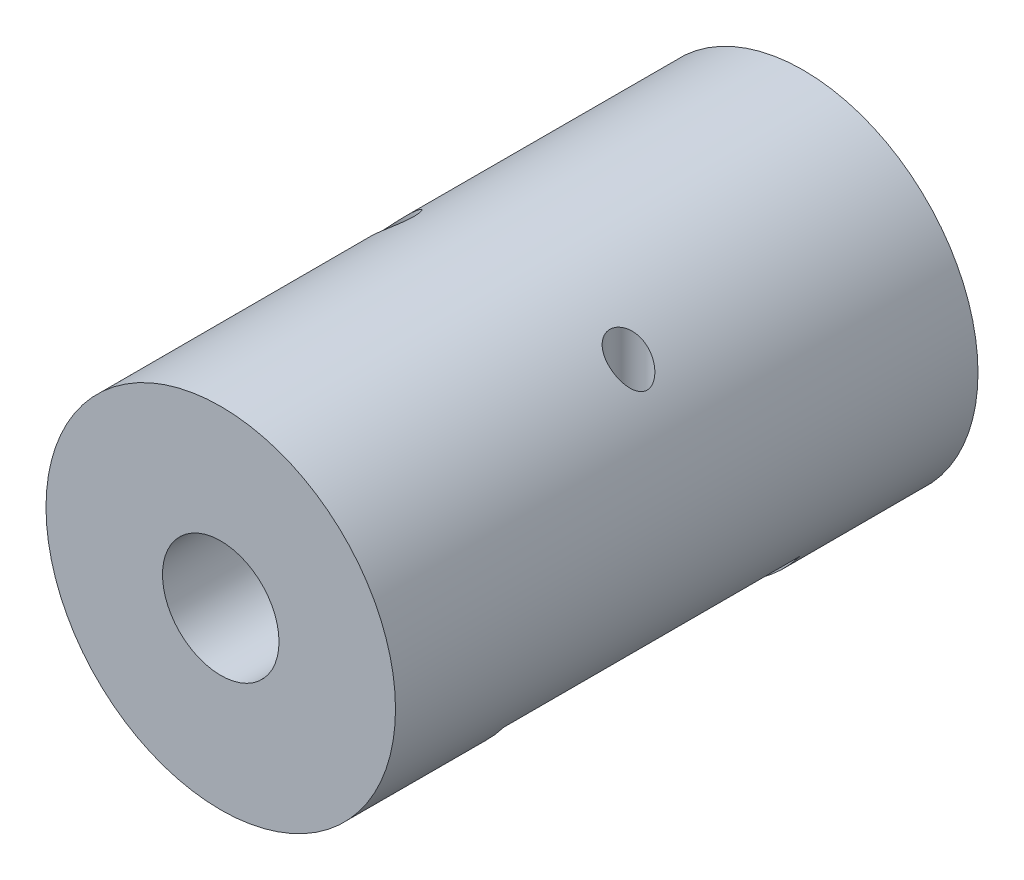
ISO-10303-21;
HEADER;
FILE_DESCRIPTION(('STEP AP214'),'2;1');
FILE_NAME('part.step','',(''),(''),'','','');
FILE_SCHEMA(('AUTOMOTIVE_DESIGN { 1 0 10303 214 1 1 1 1 }'));
ENDSEC;
DATA;
#1=APPLICATION_CONTEXT('core data for automotive mechanical design processes');
#2=APPLICATION_PROTOCOL_DEFINITION('international standard','automotive_design',2000,#1);
#3=PRODUCT_CONTEXT('',#1,'mechanical');
#4=PRODUCT('Part','Part','',(#3));
#5=PRODUCT_RELATED_PRODUCT_CATEGORY('part','',(#4));
#6=PRODUCT_DEFINITION_FORMATION('','',#4);
#7=PRODUCT_DEFINITION_CONTEXT('part definition',#1,'design');
#8=PRODUCT_DEFINITION('design','',#6,#7);
#9=PRODUCT_DEFINITION_SHAPE('','',#8);
#10=(LENGTH_UNIT() NAMED_UNIT(*) SI_UNIT(.MILLI.,.METRE.));
#11=(NAMED_UNIT(*) PLANE_ANGLE_UNIT() SI_UNIT($,.RADIAN.));
#12=(NAMED_UNIT(*) SI_UNIT($,.STERADIAN.) SOLID_ANGLE_UNIT());
#13=UNCERTAINTY_MEASURE_WITH_UNIT(LENGTH_MEASURE(1.E-05),#10,'distance_accuracy_value','');
#14=(GEOMETRIC_REPRESENTATION_CONTEXT(3) GLOBAL_UNCERTAINTY_ASSIGNED_CONTEXT((#13)) GLOBAL_UNIT_ASSIGNED_CONTEXT((#10,
#11,#12)) REPRESENTATION_CONTEXT('',''));
#15=CARTESIAN_POINT('',(0.,0.,0.));
#16=DIRECTION('',(0.,0.,1.));
#17=DIRECTION('',(1.,0.,0.));
#18=AXIS2_PLACEMENT_3D('',#15,#16,#17);
#19=CARTESIAN_POINT('',(0.,0.,25.));
#20=DIRECTION('',(0.,0.,1.));
#21=DIRECTION('',(1.,0.,0.));
#22=AXIS2_PLACEMENT_3D('',#19,#20,#21);
#23=CYLINDRICAL_SURFACE('',#22,15.);
#24=CARTESIAN_POINT('',(-11.6,9.50999474237502,0.));
#25=CARTESIAN_POINT('',(-11.5999925982214,9.51000478479375,0.0680988449643724));
#26=CARTESIAN_POINT('',(-11.5955995566398,9.51537006415514,0.13630180835427));
#27=CARTESIAN_POINT('',(-11.5784855693394,9.5361857383416,0.270126241220068));
#28=CARTESIAN_POINT('',(-11.5657432573677,9.55166200746037,0.335740628411195));
#29=CARTESIAN_POINT('',(-11.5332849408355,9.59082729220467,0.461770868010166));
#30=CARTESIAN_POINT('',(-11.5136424801118,9.61442964671478,0.522233497075484));
#31=CARTESIAN_POINT('',(-11.4686607743886,9.66804263144762,0.637881715568107));
#32=CARTESIAN_POINT('',(-11.4433201092645,9.69805485906551,0.693065984610519));
#33=CARTESIAN_POINT('',(-11.3728240310955,9.78075635008309,0.826935553530318));
#34=CARTESIAN_POINT('',(-11.3244425594717,9.83683094805927,0.901823210291912));
#35=CARTESIAN_POINT('',(-11.2196409976653,9.95620562799633,1.03921748519906));
#36=CARTESIAN_POINT('',(-11.1631988603444,10.0195254290069,1.10168898390595));
#37=CARTESIAN_POINT('',(-11.0184517443475,10.1788850220828,1.2396074457909));
#38=CARTESIAN_POINT('',(-10.9269184595659,10.2772389744453,1.30899389322695));
#39=CARTESIAN_POINT('',(-10.7347172041024,10.4778457170639,1.4257760998047));
#40=CARTESIAN_POINT('',(-10.6340411749736,10.5801018998277,1.473152229611));
#41=CARTESIAN_POINT('',(-10.423434304599,10.7876948240454,1.54707151727154));
#42=CARTESIAN_POINT('',(-10.3133449176977,10.8930486889205,1.57311568910633));
#43=CARTESIAN_POINT('',(-10.0883466426993,11.1017457300064,1.60157231361453));
#44=CARTESIAN_POINT('',(-9.97344115736072,11.2050902527682,1.60400117789178));
#45=CARTESIAN_POINT('',(-9.75715186156156,11.3936730847332,1.58467541400597));
#46=CARTESIAN_POINT('',(-9.65599769834009,11.4794939520277,1.56608795425548));
#47=CARTESIAN_POINT('',(-9.4550627964142,11.6455437114132,1.50796256820385));
#48=CARTESIAN_POINT('',(-9.35528066660579,11.7257786636694,1.46844775977578));
#49=CARTESIAN_POINT('',(-9.18129634884118,11.8622679684376,1.37741070823162));
#50=CARTESIAN_POINT('',(-9.10608902644065,11.9200398739796,1.33009293505086));
#51=CARTESIAN_POINT('',(-8.96175881647537,12.0289240786253,1.2207477297016));
#52=CARTESIAN_POINT('',(-8.8926287977248,12.0800442177679,1.15873786202992));
#53=CARTESIAN_POINT('',(-8.77456046718763,12.1659985439675,1.03175119163399));
#54=CARTESIAN_POINT('',(-8.72417800520905,12.2021268232262,0.968998424346617));
#55=CARTESIAN_POINT('',(-8.6321621547476,12.2673941416698,0.834071917169679));
#56=CARTESIAN_POINT('',(-8.59052623423417,12.296535203926,0.761900913594599));
#57=CARTESIAN_POINT('',(-8.51804501352629,12.3468572194192,0.609098724123263));
#58=CARTESIAN_POINT('',(-8.48726999843997,12.367986387778,0.528416669007282));
#59=CARTESIAN_POINT('',(-8.43893052990896,12.4010211751291,0.361390516503534));
#60=CARTESIAN_POINT('',(-8.42135771267995,12.4129326338186,0.275050041569356));
#61=CARTESIAN_POINT('',(-8.40186909114742,12.426130219492,0.109932175923426));
#62=CARTESIAN_POINT('',(-8.39839158921566,12.428476345961,0.0314200792730841));
#63=CARTESIAN_POINT('',(-8.40297979837881,12.4253748552991,-0.125095070698874));
#64=CARTESIAN_POINT('',(-8.41104167506907,12.4199298270806,-0.203098284465603));
#65=CARTESIAN_POINT('',(-8.43759998646663,12.4019007974743,-0.352736537777699));
#66=CARTESIAN_POINT('',(-8.45560869039248,12.3896503409665,-0.424500078402362));
#67=CARTESIAN_POINT('',(-8.50076724828761,12.3587095044592,-0.563605469600887));
#68=CARTESIAN_POINT('',(-8.52791811064906,12.3400184140439,-0.630946831422954));
#69=CARTESIAN_POINT('',(-8.59167265642953,12.2957201539449,-0.763060196980582));
#70=CARTESIAN_POINT('',(-8.62868147289989,12.2698136314998,-0.827534869362442));
#71=CARTESIAN_POINT('',(-8.70979033324541,12.2123716351644,-0.949053906466059));
#72=CARTESIAN_POINT('',(-8.75389274693194,12.1808342797505,-1.00609577648753));
#73=CARTESIAN_POINT('',(-8.85352877898589,12.1086440431457,-1.11890960142749));
#74=CARTESIAN_POINT('',(-8.90980267422827,12.0673428503582,-1.1736099550183));
#75=CARTESIAN_POINT('',(-9.02728392504349,11.9797136090915,-1.27269099134787));
#76=CARTESIAN_POINT('',(-9.08849523024711,11.9333815257399,-1.31706329979264));
#77=CARTESIAN_POINT('',(-9.24244267462024,11.8148382688205,-1.4133838783521));
#78=CARTESIAN_POINT('',(-9.33695914509652,11.7403708381023,-1.45974145338411));
#79=CARTESIAN_POINT('',(-9.52863493979862,11.5853523022454,-1.53243556634944));
#80=CARTESIAN_POINT('',(-9.62579786420666,11.5047926146423,-1.55874325893637));
#81=CARTESIAN_POINT('',(-9.82114299146873,11.3385104340879,-1.59310179424331));
#82=CARTESIAN_POINT('',(-9.91932134415095,11.2527331078586,-1.6009025320779));
#83=CARTESIAN_POINT('',(-10.113273266319,11.0787503446769,-1.59893146283099));
#84=CARTESIAN_POINT('',(-10.2090461178791,10.990544198925,-1.58915447137976));
#85=CARTESIAN_POINT('',(-10.4166850399835,10.7943120679393,-1.54913846485799));
#86=CARTESIAN_POINT('',(-10.5276123647381,10.6860817356522,-1.51497049491641));
#87=CARTESIAN_POINT('',(-10.7411447177531,10.4714221852125,-1.42275915006419));
#88=CARTESIAN_POINT('',(-10.8437493390436,10.3649930553376,-1.36471460846005));
#89=CARTESIAN_POINT('',(-11.0112307652167,10.1864370764417,-1.24298790641316));
#90=CARTESIAN_POINT('',(-11.0787852881642,10.1128451177744,-1.18511942668339));
#91=CARTESIAN_POINT('',(-11.2060952302414,9.97157920931768,-1.05526470470119));
#92=CARTESIAN_POINT('',(-11.2658654244488,9.90389413099595,-0.983305876663196));
#93=CARTESIAN_POINT('',(-11.3581885185525,9.79769956763222,-0.848417257487912));
#94=CARTESIAN_POINT('',(-11.3934830822265,9.75658726092283,-0.789425650702394));
#95=CARTESIAN_POINT('',(-11.4574913430679,9.6813387567985,-0.663827553184448));
#96=CARTESIAN_POINT('',(-11.4862131319035,9.64719398740052,-0.597230578477356));
#97=CARTESIAN_POINT('',(-11.5299901579119,9.5948029386852,-0.471769916106403));
#98=CARTESIAN_POINT('',(-11.5466503275508,9.57472222488295,-0.414239637822073));
#99=CARTESIAN_POINT('',(-11.5736038195443,9.54212500813552,-0.295699918080323));
#100=CARTESIAN_POINT('',(-11.5839134404265,9.52958914343397,-0.234699825563692));
#101=CARTESIAN_POINT('',(-11.5937427982294,9.51762304105103,-0.144266342660087));
#102=CARTESIAN_POINT('',(-11.5960830660976,9.51477087180676,-0.115546099082405));
#103=CARTESIAN_POINT('',(-11.5992134530783,9.51095432870064,-0.0578902158090507));
#104=CARTESIAN_POINT('',(-11.6000031471156,9.50999047250222,-0.028954519230609));
#105=CARTESIAN_POINT('',(-11.6,9.50999474237502,0.));
#106=B_SPLINE_CURVE_WITH_KNOTS('',3,(#24,#25,#26,#27,#28,#29,#30,#31,#32,#33,#34,#35,#36,#37,
#38,#39,#40,#41,#42,#43,#44,#45,#46,#47,#48,#49,#50,#51,#52,#53,#54,#55,#56,#57,#58,#59,#60,#61,
#62,#63,#64,#65,#66,#67,#68,#69,#70,#71,#72,#73,#74,#75,#76,#77,#78,#79,#80,#81,#82,#83,#84,#85,
#86,#87,#88,#89,#90,#91,#92,#93,#94,#95,#96,#97,#98,#99,#100,#101,#102,#103,#104,#105),
.UNSPECIFIED.,.T.,.F.,(4,2,2,2,2,2,2,2,2,2,2,2,2,2,2,2,2,2,2,2,2,2,2,2,2,2,2,2,2,2,2,2,2,2,2,2,
2,2,2,2,4),(0.,0.204150327636968,0.408825138608906,0.61138153332754,0.813988465854817,
1.12819223155212,1.44327246392442,1.89452294521242,2.34617509374427,2.80811246199375,
3.26972878105092,3.67007313097447,4.06997615101961,4.3867365346221,4.70312012304896,
4.96667882258208,5.23016111921661,5.49531852566042,5.7603078090536,5.99497054116305,
6.2295553156079,6.453544885256,6.67755916934784,6.91278644389419,7.14809246643366,
7.41313709649812,7.67839588995922,8.06313980926915,8.44843621212934,8.83891060794228,
9.22950018903983,9.70362384797424,10.1777706770153,10.5231295669891,10.8678230852102,
11.1074041568611,11.3466886769735,11.5354821778228,11.7237891036779,11.8105667104811,
11.8973681032301),.UNSPECIFIED.);
#107=CARTESIAN_POINT('',(-11.6,9.50999474237502,0.));
#108=VERTEX_POINT('',#107);
#109=EDGE_CURVE('E131',#108,#108,#106,.T.);
#110=ORIENTED_EDGE('',*,*,#109,.F.);
#111=EDGE_LOOP('',(#110));
#112=FACE_BOUND('',#111,.T.);
#113=CARTESIAN_POINT('',(8.4,12.4273891063248,0.));
#114=CARTESIAN_POINT('',(8.40000501006103,12.4273864323887,0.0780335395132181));
#115=CARTESIAN_POINT('',(8.40574774875426,12.4235100308816,0.156165504121463));
#116=CARTESIAN_POINT('',(8.42840512734708,12.4081491345236,0.310109160515021));
#117=CARTESIAN_POINT('',(8.44534148790919,12.3966498477155,0.385916040725357));
#118=CARTESIAN_POINT('',(8.48934713679184,12.3665551396632,0.532705897116737));
#119=CARTESIAN_POINT('',(8.51637860576112,12.3479861985076,0.603705723691785));
#120=CARTESIAN_POINT('',(8.57919099938772,12.3044274739463,0.739530696125875));
#121=CARTESIAN_POINT('',(8.61497047825421,12.2794387515085,0.804356859853805));
#122=CARTESIAN_POINT('',(8.69580776581861,12.2223359235264,0.930031022890248));
#123=CARTESIAN_POINT('',(8.74125731825261,12.1899139605443,0.990485099074101));
#124=CARTESIAN_POINT('',(8.83829695632284,12.1197399142812,1.10270445196467));
#125=CARTESIAN_POINT('',(8.88988930516468,12.0819858655269,1.15446650921429));
#126=CARTESIAN_POINT('',(9.00599192406868,11.9957536448922,1.25651041360136));
#127=CARTESIAN_POINT('',(9.07125972658625,11.9465220022162,1.3052900555671));
#128=CARTESIAN_POINT('',(9.20561071483371,11.8433079031617,1.39115659646975));
#129=CARTESIAN_POINT('',(9.27469742783348,11.7893210264365,1.42823246597624));
#130=CARTESIAN_POINT('',(9.4482293802364,11.6511089991804,1.50611778446109));
#131=CARTESIAN_POINT('',(9.55390047917185,11.5646887713045,1.54035443460607));
#132=CARTESIAN_POINT('',(9.76557437937609,11.3865179812565,1.58644674272066));
#133=CARTESIAN_POINT('',(9.87157742845832,11.2947610155356,1.59827491691371));
#134=CARTESIAN_POINT('',(10.0823414259178,11.1070497467956,1.60139352270251));
#135=CARTESIAN_POINT('',(10.1870715890862,11.0110579682212,1.59243242788286));
#136=CARTESIAN_POINT('',(10.392016417595,10.8178480236531,1.55473409339015));
#137=CARTESIAN_POINT('',(10.4922250431935,10.7206284270918,1.52597119040023));
#138=CARTESIAN_POINT('',(10.6457314729924,10.5676308587971,1.46517280611132));
#139=CARTESIAN_POINT('',(10.7012024415749,10.5114376417781,1.43947633525288));
#140=CARTESIAN_POINT('',(10.8095877514249,10.3999445522323,1.38143007831341));
#141=CARTESIAN_POINT('',(10.8625010887007,10.3446450361052,1.34907770525211));
#142=CARTESIAN_POINT('',(10.9651732613713,10.2357493354301,1.27763249635676));
#143=CARTESIAN_POINT('',(11.0149387265439,10.1821496982097,1.23855451890777));
#144=CARTESIAN_POINT('',(11.1108227039199,10.0774327539105,1.15333560107726));
#145=CARTESIAN_POINT('',(11.1569445284109,10.0263132089828,1.10720119011668));
#146=CARTESIAN_POINT('',(11.2472959518478,9.92487778062165,1.00458534899935));
#147=CARTESIAN_POINT('',(11.2912695578093,9.87477220444364,0.947665253375463));
#148=CARTESIAN_POINT('',(11.3729033784788,9.78064092161109,0.824955011752293));
#149=CARTESIAN_POINT('',(11.41057318591,9.73660599535306,0.759178623125741));
#150=CARTESIAN_POINT('',(11.4707880161794,9.66554378779925,0.632946353575663));
#151=CARTESIAN_POINT('',(11.4948507341616,9.63687985998682,0.57415029726972));
#152=CARTESIAN_POINT('',(11.5364103947229,9.58708983418451,0.451254995664603));
#153=CARTESIAN_POINT('',(11.5539162876033,9.56595346276278,0.387163126384852));
#154=CARTESIAN_POINT('',(11.5788771003766,9.53571870379198,0.265306503987981));
#155=CARTESIAN_POINT('',(11.5874755462278,9.52525487055583,0.20811923328253));
#156=CARTESIAN_POINT('',(11.5983934519584,9.51195813140747,0.092278395913196));
#157=CARTESIAN_POINT('',(11.6007169589104,9.50912030704493,0.0336257989744889));
#158=CARTESIAN_POINT('',(11.5988950959715,9.51134237139937,-0.0834524943068132));
#159=CARTESIAN_POINT('',(11.5947465835119,9.51640609681128,-0.141878066603561));
#160=CARTESIAN_POINT('',(11.580318431115,9.53395772180998,-0.256822529286114));
#161=CARTESIAN_POINT('',(11.5700343474282,9.54645100230599,-0.313340006337129));
#162=CARTESIAN_POINT('',(11.540809828646,9.58177171261287,-0.43688967344468));
#163=CARTESIAN_POINT('',(11.5203533829918,9.60639565839772,-0.503044824428059));
#164=CARTESIAN_POINT('',(11.4726144837359,9.66335858719212,-0.629272897523933));
#165=CARTESIAN_POINT('',(11.4453197536963,9.69571144062564,-0.689334604949627));
#166=CARTESIAN_POINT('',(11.372477050616,9.78115993152418,-0.827499294818293));
#167=CARTESIAN_POINT('',(11.3241222472107,9.83719934510696,-0.902285176503839));
#168=CARTESIAN_POINT('',(11.2194237371596,9.95644950183978,-1.03945989014257));
#169=CARTESIAN_POINT('',(11.1630633404933,10.0196751703977,-1.1018221518089));
#170=CARTESIAN_POINT('',(11.0184065511493,10.1789340073445,-1.23964470052813));
#171=CARTESIAN_POINT('',(10.9268728256456,10.2772875099121,-1.30902615591818));
#172=CARTESIAN_POINT('',(10.7346586354243,10.4779059357173,-1.42580714750543));
#173=CARTESIAN_POINT('',(10.6339689523012,10.5801747396352,-1.47318422955666));
#174=CARTESIAN_POINT('',(10.4233429455032,10.7877831873615,-1.54709678056997));
#175=CARTESIAN_POINT('',(10.3132486905799,10.8931398690463,-1.57313514050557));
#176=CARTESIAN_POINT('',(10.0882419440201,11.1018409207552,-1.60157827887548));
#177=CARTESIAN_POINT('',(9.97333289149169,11.2051866524208,-1.60399964688264));
#178=CARTESIAN_POINT('',(9.75704430588523,11.3937651209601,-1.58465873553458));
#179=CARTESIAN_POINT('',(9.65589437415398,11.4795807825184,-1.56606506991856));
#180=CARTESIAN_POINT('',(9.4549688640736,11.6456198968177,-1.50792840395435));
#181=CARTESIAN_POINT('',(9.3551918940421,11.7258494078726,-1.468408512022));
#182=CARTESIAN_POINT('',(9.18121425160337,11.8623314944381,-1.37736203797725));
#183=CARTESIAN_POINT('',(9.10600842631398,11.9201014224836,-1.33003900210567));
#184=CARTESIAN_POINT('',(8.96168748805932,12.0289771492069,-1.22068657729978));
#185=CARTESIAN_POINT('',(8.89256481359634,12.0800912602592,-1.15867581007425));
#186=CARTESIAN_POINT('',(8.77451914188441,12.1660282418925,-1.03170110154618));
#187=CARTESIAN_POINT('',(8.72415087521281,12.2021461427756,-0.968962329558952));
#188=CARTESIAN_POINT('',(8.63213910719579,12.2674104133589,-0.834034436848432));
#189=CARTESIAN_POINT('',(8.59049687028529,12.2965557727977,-0.76184394899466));
#190=CARTESIAN_POINT('',(8.51797829632273,12.3469033548838,-0.608953095268276));
#191=CARTESIAN_POINT('',(8.48718167395217,12.3680468455376,-0.52819517337348));
#192=CARTESIAN_POINT('',(8.43887616911714,12.4010582205576,-0.361119067808462));
#193=CARTESIAN_POINT('',(8.42133099754205,12.4129514394858,-0.274816776767866));
#194=CARTESIAN_POINT('',(8.40735050236986,12.4224179850055,-0.156375989937393));
#195=CARTESIAN_POINT('',(8.40459836550588,12.4242798941452,-0.125198568336057));
#196=CARTESIAN_POINT('',(8.40092212025064,12.4267659835816,-0.0626860587727466));
#197=CARTESIAN_POINT('',(8.39999798714388,12.4273901806128,-0.0313509729482118));
#198=CARTESIAN_POINT('',(8.4,12.4273891063248,0.));
#199=B_SPLINE_CURVE_WITH_KNOTS('',3,(#113,#114,#115,#116,#117,#118,#119,#120,#121,#122,#123,
#124,#125,#126,#127,#128,#129,#130,#131,#132,#133,#134,#135,#136,#137,#138,#139,#140,#141,#142,
#143,#144,#145,#146,#147,#148,#149,#150,#151,#152,#153,#154,#155,#156,#157,#158,#159,#160,#161,
#162,#163,#164,#165,#166,#167,#168,#169,#170,#171,#172,#173,#174,#175,#176,#177,#178,#179,#180,
#181,#182,#183,#184,#185,#186,#187,#188,#189,#190,#191,#192,#193,#194,#195,#196,#197,#198),
.UNSPECIFIED.,.T.,.F.,(4,2,2,2,2,2,2,2,2,2,2,2,2,2,2,2,2,2,2,2,2,2,2,2,2,2,2,2,2,2,2,2,2,2,2,2,
2,2,2,2,2,2,4),(0.,0.233971814542686,0.468398977898754,0.701956574715617,0.935475597336678,
1.18139228924052,1.42739986684405,1.71194633324149,1.99676015621575,2.41668862218282,
2.83713179371065,3.26268833118225,3.68879743447302,3.93764476038661,4.18658899028993,
4.43499014464942,4.68316282497368,4.94542177588173,5.20727793519904,5.41561991148949,
5.62367644797957,5.7992036391575,5.97461759558571,6.15011675293097,6.32574317188197,
6.54501139565279,6.76467611758698,7.07859661970665,7.39318145857598,7.84442689479301,
8.29613179372164,8.75808236774915,9.21970842478834,9.62003587084746,10.0199221623789,
10.3366831973036,10.6530447592119,10.9165395803175,11.1800725564629,11.4455039315642,
11.7102057603781,11.8042082015362,11.898209371727),.UNSPECIFIED.);
#200=CARTESIAN_POINT('',(8.4,12.4273891063248,0.));
#201=VERTEX_POINT('',#200);
#202=EDGE_CURVE('E68',#201,#201,#199,.T.);
#203=ORIENTED_EDGE('',*,*,#202,.F.);
#204=EDGE_LOOP('',(#203));
#205=FACE_BOUND('',#204,.T.);
#206=CARTESIAN_POINT('',(0.,0.,25.));
#207=DIRECTION('',(0.,0.,1.));
#208=DIRECTION('',(1.,0.,0.));
#209=AXIS2_PLACEMENT_3D('',#206,#207,#208);
#210=CIRCLE('',#209,15.);
#211=CARTESIAN_POINT('',(15.,0.,25.));
#212=VERTEX_POINT('',#211);
#213=EDGE_CURVE('E80',#212,#212,#210,.T.);
#214=ORIENTED_EDGE('',*,*,#213,.F.);
#215=EDGE_LOOP('',(#214));
#216=FACE_BOUND('',#215,.T.);
#217=CARTESIAN_POINT('',(0.,0.,-25.));
#218=DIRECTION('',(0.,0.,1.));
#219=DIRECTION('',(1.,0.,0.));
#220=AXIS2_PLACEMENT_3D('',#217,#218,#219);
#221=CIRCLE('',#220,15.);
#222=CARTESIAN_POINT('',(15.,0.,-25.));
#223=VERTEX_POINT('',#222);
#224=EDGE_CURVE('E64',#223,#223,#221,.T.);
#225=ORIENTED_EDGE('',*,*,#224,.T.);
#226=EDGE_LOOP('',(#225));
#227=FACE_BOUND('',#226,.T.);
#228=DIRECTION('',(0.,0.,1.));
#229=VECTOR('',#228,1.);
#230=CARTESIAN_POINT('',(-12.,-9.,25.));
#231=LINE('',#230,#229);
#232=CARTESIAN_POINT('',(-12.,-9.,-12.7));
#233=VERTEX_POINT('',#232);
#234=CARTESIAN_POINT('',(-12.,-9.,12.7));
#235=VERTEX_POINT('',#234);
#236=EDGE_CURVE('E63',#233,#235,#231,.T.);
#237=ORIENTED_EDGE('',*,*,#236,.T.);
#238=CARTESIAN_POINT('',(0.,0.,12.7));
#239=DIRECTION('',(0.,0.,-1.));
#240=DIRECTION('',(-1.,0.,0.));
#241=AXIS2_PLACEMENT_3D('',#238,#239,#240);
#242=CIRCLE('',#241,15.);
#243=CARTESIAN_POINT('',(12.,-9.,12.7));
#244=VERTEX_POINT('',#243);
#245=EDGE_CURVE('E11',#235,#244,#242,.F.);
#246=ORIENTED_EDGE('',*,*,#245,.T.);
#247=DIRECTION('',(0.,0.,1.));
#248=VECTOR('',#247,1.);
#249=CARTESIAN_POINT('',(12.,-9.,25.));
#250=LINE('',#249,#248);
#251=CARTESIAN_POINT('',(12.,-9.,-12.7));
#252=VERTEX_POINT('',#251);
#253=EDGE_CURVE('E39',#244,#252,#250,.F.);
#254=ORIENTED_EDGE('',*,*,#253,.T.);
#255=CARTESIAN_POINT('',(0.,0.,-12.7));
#256=DIRECTION('',(0.,0.,-1.));
#257=DIRECTION('',(-1.,0.,0.));
#258=AXIS2_PLACEMENT_3D('',#255,#256,#257);
#259=CIRCLE('',#258,15.);
#260=EDGE_CURVE('E57',#233,#252,#259,.F.);
#261=ORIENTED_EDGE('',*,*,#260,.F.);
#262=EDGE_LOOP('',(#237,#246,#254,#261));
#263=FACE_BOUND('',#262,.T.);
#264=ADVANCED_FACE('F31',(#112,#205,#216,#227,#263),#23,.T.);
#265=CARTESIAN_POINT('',(15.,0.,-25.));
#266=DIRECTION('',(0.,0.,-1.));
#267=DIRECTION('',(-1.,0.,0.));
#268=AXIS2_PLACEMENT_3D('',#265,#266,#267);
#269=PLANE('',#268);
#270=CARTESIAN_POINT('',(0.,0.,-25.));
#271=DIRECTION('',(0.,0.,1.));
#272=DIRECTION('',(1.,0.,0.));
#273=AXIS2_PLACEMENT_3D('',#270,#271,#272);
#274=CIRCLE('',#273,5.);
#275=CARTESIAN_POINT('',(5.,0.,-25.));
#276=VERTEX_POINT('',#275);
#277=EDGE_CURVE('E74',#276,#276,#274,.T.);
#278=ORIENTED_EDGE('',*,*,#277,.T.);
#279=EDGE_LOOP('',(#278));
#280=FACE_BOUND('',#279,.T.);
#281=ORIENTED_EDGE('',*,*,#224,.F.);
#282=EDGE_LOOP('',(#281));
#283=FACE_BOUND('',#282,.T.);
#284=ADVANCED_FACE('F113',(#280,#283),#269,.T.);
#285=CARTESIAN_POINT('',(0.,0.,25.));
#286=DIRECTION('',(0.,0.,1.));
#287=DIRECTION('',(1.,0.,0.));
#288=AXIS2_PLACEMENT_3D('',#285,#286,#287);
#289=CYLINDRICAL_SURFACE('',#288,5.);
#290=CARTESIAN_POINT('',(0.,0.,25.));
#291=DIRECTION('',(0.,0.,1.));
#292=DIRECTION('',(1.,0.,0.));
#293=AXIS2_PLACEMENT_3D('',#290,#291,#292);
#294=CIRCLE('',#293,5.);
#295=CARTESIAN_POINT('',(5.,0.,25.));
#296=VERTEX_POINT('',#295);
#297=EDGE_CURVE('E77',#296,#296,#294,.T.);
#298=ORIENTED_EDGE('',*,*,#297,.T.);
#299=EDGE_LOOP('',(#298));
#300=FACE_BOUND('',#299,.T.);
#301=ORIENTED_EDGE('',*,*,#277,.F.);
#302=EDGE_LOOP('',(#301));
#303=FACE_BOUND('',#302,.T.);
#304=ADVANCED_FACE('F110',(#300,#303),#289,.F.);
#305=CARTESIAN_POINT('',(15.,0.,25.));
#306=DIRECTION('',(0.,0.,1.));
#307=DIRECTION('',(1.,0.,0.));
#308=AXIS2_PLACEMENT_3D('',#305,#306,#307);
#309=PLANE('',#308);
#310=ORIENTED_EDGE('',*,*,#213,.T.);
#311=EDGE_LOOP('',(#310));
#312=FACE_BOUND('',#311,.T.);
#313=ORIENTED_EDGE('',*,*,#297,.F.);
#314=EDGE_LOOP('',(#313));
#315=FACE_BOUND('',#314,.T.);
#316=ADVANCED_FACE('F106',(#312,#315),#309,.T.);
#317=CARTESIAN_POINT('',(-15.,-9.,12.7));
#318=DIRECTION('',(0.,-1.,0.));
#319=DIRECTION('',(0.,0.,-1.));
#320=AXIS2_PLACEMENT_3D('',#317,#318,#319);
#321=PLANE('',#320);
#322=CARTESIAN_POINT('',(-10.,-9.,0.));
#323=DIRECTION('',(0.,1.,0.));
#324=DIRECTION('',(-1.,0.,0.));
#325=AXIS2_PLACEMENT_3D('',#322,#323,#324);
#326=CIRCLE('',#325,1.6);
#327=CARTESIAN_POINT('',(-11.6,-9.,0.));
#328=VERTEX_POINT('',#327);
#329=EDGE_CURVE('E141',#328,#328,#326,.T.);
#330=ORIENTED_EDGE('',*,*,#329,.T.);
#331=EDGE_LOOP('',(#330));
#332=FACE_BOUND('',#331,.T.);
#333=CARTESIAN_POINT('',(10.,-9.,0.));
#334=DIRECTION('',(0.,1.,0.));
#335=DIRECTION('',(-1.,0.,0.));
#336=AXIS2_PLACEMENT_3D('',#333,#334,#335);
#337=CIRCLE('',#336,1.6);
#338=CARTESIAN_POINT('',(8.4,-9.,0.));
#339=VERTEX_POINT('',#338);
#340=EDGE_CURVE('E89',#339,#339,#337,.T.);
#341=ORIENTED_EDGE('',*,*,#340,.T.);
#342=EDGE_LOOP('',(#341));
#343=FACE_BOUND('',#342,.T.);
#344=DIRECTION('',(-1.,0.,0.));
#345=VECTOR('',#344,1.);
#346=CARTESIAN_POINT('',(-15.,-9.,12.7));
#347=LINE('',#346,#345);
#348=EDGE_CURVE('E67',#244,#235,#347,.T.);
#349=ORIENTED_EDGE('',*,*,#348,.T.);
#350=ORIENTED_EDGE('',*,*,#236,.F.);
#351=DIRECTION('',(-1.,0.,0.));
#352=VECTOR('',#351,1.);
#353=CARTESIAN_POINT('',(-15.,-9.,-12.7));
#354=LINE('',#353,#352);
#355=EDGE_CURVE('E59',#252,#233,#354,.T.);
#356=ORIENTED_EDGE('',*,*,#355,.F.);
#357=ORIENTED_EDGE('',*,*,#253,.F.);
#358=EDGE_LOOP('',(#349,#350,#356,#357));
#359=FACE_BOUND('',#358,.T.);
#360=ADVANCED_FACE('F66',(#332,#343,#359),#321,.T.);
#361=CARTESIAN_POINT('',(-15.,-9.,12.7));
#362=DIRECTION('',(0.,0.,-1.));
#363=DIRECTION('',(-1.,0.,0.));
#364=AXIS2_PLACEMENT_3D('',#361,#362,#363);
#365=PLANE('',#364);
#366=ORIENTED_EDGE('',*,*,#348,.F.);
#367=ORIENTED_EDGE('',*,*,#245,.F.);
#368=EDGE_LOOP('',(#366,#367));
#369=FACE_BOUND('',#368,.T.);
#370=ADVANCED_FACE('F101',(#369),#365,.T.);
#371=CARTESIAN_POINT('',(-15.,-9.,-12.7));
#372=DIRECTION('',(0.,0.,-1.));
#373=DIRECTION('',(-1.,0.,0.));
#374=AXIS2_PLACEMENT_3D('',#371,#372,#373);
#375=PLANE('',#374);
#376=ORIENTED_EDGE('',*,*,#355,.T.);
#377=ORIENTED_EDGE('',*,*,#260,.T.);
#378=EDGE_LOOP('',(#376,#377));
#379=FACE_BOUND('',#378,.T.);
#380=ADVANCED_FACE('F58',(#379),#375,.F.);
#381=CARTESIAN_POINT('',(10.,-9.,0.));
#382=DIRECTION('',(0.,1.,0.));
#383=DIRECTION('',(-1.,0.,0.));
#384=AXIS2_PLACEMENT_3D('',#381,#382,#383);
#385=CYLINDRICAL_SURFACE('',#384,1.59999999999999);
#386=ORIENTED_EDGE('',*,*,#202,.T.);
#387=EDGE_LOOP('',(#386));
#388=FACE_BOUND('',#387,.T.);
#389=ORIENTED_EDGE('',*,*,#340,.F.);
#390=EDGE_LOOP('',(#389));
#391=FACE_BOUND('',#390,.T.);
#392=ADVANCED_FACE('F91',(#388,#391),#385,.F.);
#393=CARTESIAN_POINT('',(-10.,-9.,0.));
#394=DIRECTION('',(0.,1.,0.));
#395=DIRECTION('',(-1.,0.,0.));
#396=AXIS2_PLACEMENT_3D('',#393,#394,#395);
#397=CYLINDRICAL_SURFACE('',#396,1.59999999999999);
#398=ORIENTED_EDGE('',*,*,#109,.T.);
#399=EDGE_LOOP('',(#398));
#400=FACE_BOUND('',#399,.T.);
#401=ORIENTED_EDGE('',*,*,#329,.F.);
#402=EDGE_LOOP('',(#401));
#403=FACE_BOUND('',#402,.T.);
#404=ADVANCED_FACE('F96',(#400,#403),#397,.F.);
#405=CLOSED_SHELL('',(#264,#284,#304,#316,#360,#370,#380,#392,#404));
#406=MANIFOLD_SOLID_BREP('B2',#405);
#407=ADVANCED_BREP_SHAPE_REPRESENTATION('',(#18,#406),#14);
#408=SHAPE_DEFINITION_REPRESENTATION(#9,#407);
ENDSEC;
END-ISO-10303-21;
